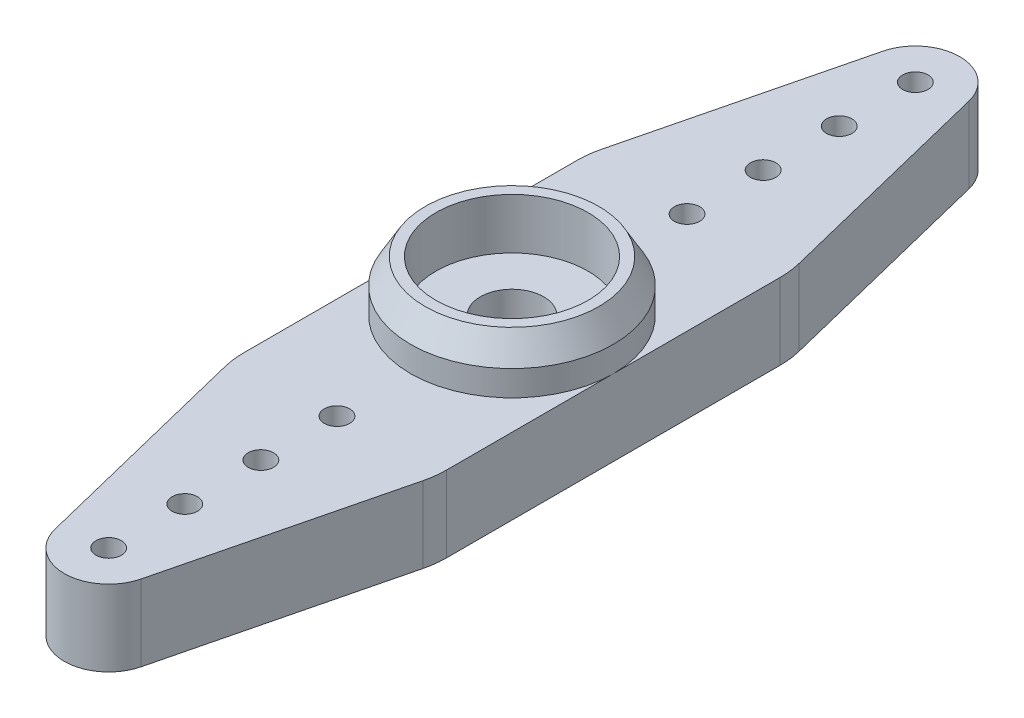
ISO-10303-21;
HEADER;
FILE_DESCRIPTION(('STEP AP214'),'2;1');
FILE_NAME('part.step','',(''),(''),'','','');
FILE_SCHEMA(('AUTOMOTIVE_DESIGN { 1 0 10303 214 1 1 1 1 }'));
ENDSEC;
DATA;
#1=APPLICATION_CONTEXT('core data for automotive mechanical design processes');
#2=APPLICATION_PROTOCOL_DEFINITION('international standard','automotive_design',2000,#1);
#3=PRODUCT_CONTEXT('',#1,'mechanical');
#4=PRODUCT('Part','Part','',(#3));
#5=PRODUCT_RELATED_PRODUCT_CATEGORY('part','',(#4));
#6=PRODUCT_DEFINITION_FORMATION('','',#4);
#7=PRODUCT_DEFINITION_CONTEXT('part definition',#1,'design');
#8=PRODUCT_DEFINITION('design','',#6,#7);
#9=PRODUCT_DEFINITION_SHAPE('','',#8);
#10=(LENGTH_UNIT() NAMED_UNIT(*) SI_UNIT(.MILLI.,.METRE.));
#11=(NAMED_UNIT(*) PLANE_ANGLE_UNIT() SI_UNIT($,.RADIAN.));
#12=(NAMED_UNIT(*) SI_UNIT($,.STERADIAN.) SOLID_ANGLE_UNIT());
#13=UNCERTAINTY_MEASURE_WITH_UNIT(LENGTH_MEASURE(1.E-05),#10,'distance_accuracy_value','');
#14=(GEOMETRIC_REPRESENTATION_CONTEXT(3) GLOBAL_UNCERTAINTY_ASSIGNED_CONTEXT((#13)) GLOBAL_UNIT_ASSIGNED_CONTEXT((#10,
#11,#12)) REPRESENTATION_CONTEXT('',''));
#15=CARTESIAN_POINT('',(0.,0.,0.));
#16=DIRECTION('',(0.,0.,1.));
#17=DIRECTION('',(1.,0.,0.));
#18=AXIS2_PLACEMENT_3D('',#15,#16,#17);
#19=CARTESIAN_POINT('',(0.,3.,0.));
#20=DIRECTION('',(0.,1.,0.));
#21=DIRECTION('',(0.,0.,1.));
#22=AXIS2_PLACEMENT_3D('',#19,#20,#21);
#23=PLANE('',#22);
#24=CARTESIAN_POINT('',(0.,3.,0.));
#25=DIRECTION('',(0.,1.,0.));
#26=DIRECTION('',(0.,0.,1.));
#27=AXIS2_PLACEMENT_3D('',#24,#25,#26);
#28=CIRCLE('',#27,4.);
#29=CARTESIAN_POINT('',(4.,3.,0.));
#30=VERTEX_POINT('',#29);
#31=CARTESIAN_POINT('',(-4.,3.,0.));
#32=VERTEX_POINT('',#31);
#33=EDGE_CURVE('E165',#30,#32,#28,.T.);
#34=ORIENTED_EDGE('',*,*,#33,.F.);
#35=DIRECTION('',(0.,0.,-1.));
#36=VECTOR('',#35,1.);
#37=CARTESIAN_POINT('',(4.,3.,-6.57429368146869));
#38=LINE('',#37,#36);
#39=CARTESIAN_POINT('',(4.,3.,-6.57429368146869));
#40=VERTEX_POINT('',#39);
#41=EDGE_CURVE('E93',#30,#40,#38,.T.);
#42=ORIENTED_EDGE('',*,*,#41,.T.);
#43=CARTESIAN_POINT('',(0.5,3.,-6.57429368146869));
#44=DIRECTION('',(0.,1.,0.));
#45=DIRECTION('',(0.,0.,-1.));
#46=AXIS2_PLACEMENT_3D('',#43,#44,#45);
#47=CIRCLE('',#46,3.5);
#48=CARTESIAN_POINT('',(3.89795205229431,3.,-7.41329418820803));
#49=VERTEX_POINT('',#48);
#50=EDGE_CURVE('E319',#40,#49,#47,.T.);
#51=ORIENTED_EDGE('',*,*,#50,.T.);
#52=DIRECTION('',(-0.239714430496953,0.,-0.970843443512661));
#53=VECTOR('',#52,1.);
#54=CARTESIAN_POINT('',(1.69897602614716,3.,-16.319147094104));
#55=LINE('',#54,#53);
#56=CARTESIAN_POINT('',(1.69897602614716,3.,-16.319147094104));
#57=VERTEX_POINT('',#56);
#58=EDGE_CURVE('E111',#49,#57,#55,.T.);
#59=ORIENTED_EDGE('',*,*,#58,.T.);
#60=CARTESIAN_POINT('',(0.,3.,-15.8996468407343));
#61=DIRECTION('',(0.,1.,0.));
#62=DIRECTION('',(0.,0.,-1.));
#63=AXIS2_PLACEMENT_3D('',#60,#61,#62);
#64=CIRCLE('',#63,1.75);
#65=CARTESIAN_POINT('',(-1.69897602614716,3.,-16.319147094104));
#66=VERTEX_POINT('',#65);
#67=EDGE_CURVE('E104',#57,#66,#64,.T.);
#68=ORIENTED_EDGE('',*,*,#67,.T.);
#69=DIRECTION('',(-0.239714430496953,0.,0.970843443512661));
#70=VECTOR('',#69,1.);
#71=CARTESIAN_POINT('',(-3.89795205229431,3.,-7.41329418820803));
#72=LINE('',#71,#70);
#73=CARTESIAN_POINT('',(-3.89795205229431,3.,-7.41329418820803));
#74=VERTEX_POINT('',#73);
#75=EDGE_CURVE('E108',#66,#74,#72,.T.);
#76=ORIENTED_EDGE('',*,*,#75,.T.);
#77=CARTESIAN_POINT('',(-0.5,3.,-6.57429368146869));
#78=DIRECTION('',(0.,1.,0.));
#79=DIRECTION('',(0.,0.,-1.));
#80=AXIS2_PLACEMENT_3D('',#77,#78,#79);
#81=CIRCLE('',#80,3.5);
#82=CARTESIAN_POINT('',(-4.,3.,-6.57429368146869));
#83=VERTEX_POINT('',#82);
#84=EDGE_CURVE('E58',#74,#83,#81,.T.);
#85=ORIENTED_EDGE('',*,*,#84,.T.);
#86=DIRECTION('',(0.,0.,1.));
#87=VECTOR('',#86,1.);
#88=CARTESIAN_POINT('',(-4.,3.,0.));
#89=LINE('',#88,#87);
#90=EDGE_CURVE('E132',#83,#32,#89,.T.);
#91=ORIENTED_EDGE('',*,*,#90,.T.);
#92=EDGE_LOOP('',(#34,#42,#51,#59,#68,#76,#85,#91));
#93=FACE_BOUND('',#92,.T.);
#94=CARTESIAN_POINT('',(0.,3.,-6.89964684073435));
#95=DIRECTION('',(0.,1.,0.));
#96=DIRECTION('',(0.,0.,1.));
#97=AXIS2_PLACEMENT_3D('',#94,#95,#96);
#98=CIRCLE('',#97,0.500000000000001);
#99=CARTESIAN_POINT('',(0.,3.,-6.39964684073434));
#100=VERTEX_POINT('',#99);
#101=EDGE_CURVE('E293',#100,#100,#98,.T.);
#102=ORIENTED_EDGE('',*,*,#101,.F.);
#103=EDGE_LOOP('',(#102));
#104=FACE_BOUND('',#103,.T.);
#105=CARTESIAN_POINT('',(0.,3.,-12.8996468407343));
#106=DIRECTION('',(0.,1.,0.));
#107=DIRECTION('',(0.,0.,1.));
#108=AXIS2_PLACEMENT_3D('',#105,#106,#107);
#109=CIRCLE('',#108,0.500000000000001);
#110=CARTESIAN_POINT('',(0.,3.,-12.3996468407343));
#111=VERTEX_POINT('',#110);
#112=EDGE_CURVE('E305',#111,#111,#109,.T.);
#113=ORIENTED_EDGE('',*,*,#112,.F.);
#114=EDGE_LOOP('',(#113));
#115=FACE_BOUND('',#114,.T.);
#116=CARTESIAN_POINT('',(0.,3.,-15.8996468407343));
#117=DIRECTION('',(0.,1.,0.));
#118=DIRECTION('',(0.,0.,1.));
#119=AXIS2_PLACEMENT_3D('',#116,#117,#118);
#120=CIRCLE('',#119,0.500000000000001);
#121=CARTESIAN_POINT('',(0.,3.,-15.3996468407343));
#122=VERTEX_POINT('',#121);
#123=EDGE_CURVE('E139',#122,#122,#120,.T.);
#124=ORIENTED_EDGE('',*,*,#123,.F.);
#125=EDGE_LOOP('',(#124));
#126=FACE_BOUND('',#125,.T.);
#127=CARTESIAN_POINT('',(0.,3.,-9.89964684073435));
#128=DIRECTION('',(0.,1.,0.));
#129=DIRECTION('',(0.,0.,1.));
#130=AXIS2_PLACEMENT_3D('',#127,#128,#129);
#131=CIRCLE('',#130,0.500000000000001);
#132=CARTESIAN_POINT('',(0.,3.,-9.39964684073435));
#133=VERTEX_POINT('',#132);
#134=EDGE_CURVE('E299',#133,#133,#131,.T.);
#135=ORIENTED_EDGE('',*,*,#134,.F.);
#136=EDGE_LOOP('',(#135));
#137=FACE_BOUND('',#136,.T.);
#138=ADVANCED_FACE('F34',(#93,#104,#115,#126,#137),#23,.T.);
#139=CARTESIAN_POINT('',(0.,3.,0.));
#140=DIRECTION('',(0.,-1.,0.));
#141=DIRECTION('',(0.,0.,1.));
#142=AXIS2_PLACEMENT_3D('',#139,#140,#141);
#143=CIRCLE('',#142,1.25);
#144=CARTESIAN_POINT('',(0.,3.,1.25));
#145=VERTEX_POINT('',#144);
#146=EDGE_CURVE('E152',#145,#145,#143,.T.);
#147=ORIENTED_EDGE('',*,*,#146,.T.);
#148=EDGE_LOOP('',(#147));
#149=FACE_BOUND('',#148,.T.);
#150=CARTESIAN_POINT('',(0.,3.,0.));
#151=DIRECTION('',(0.,1.,0.));
#152=DIRECTION('',(0.,0.,1.));
#153=AXIS2_PLACEMENT_3D('',#150,#151,#152);
#154=CIRCLE('',#153,3.);
#155=CARTESIAN_POINT('',(0.,3.,3.));
#156=VERTEX_POINT('',#155);
#157=EDGE_CURVE('E177',#156,#156,#154,.T.);
#158=ORIENTED_EDGE('',*,*,#157,.T.);
#159=EDGE_LOOP('',(#158));
#160=FACE_BOUND('',#159,.T.);
#161=ADVANCED_FACE('F184',(#149,#160),#23,.T.);
#162=EDGE_CURVE('E49',#32,#30,#28,.T.);
#163=ORIENTED_EDGE('',*,*,#162,.F.);
#164=CARTESIAN_POINT('',(-4.,3.,6.57429368146869));
#165=VERTEX_POINT('',#164);
#166=EDGE_CURVE('E128',#32,#165,#89,.T.);
#167=ORIENTED_EDGE('',*,*,#166,.T.);
#168=CARTESIAN_POINT('',(-0.5,3.,6.57429368146869));
#169=DIRECTION('',(0.,1.,0.));
#170=DIRECTION('',(0.,0.,1.));
#171=AXIS2_PLACEMENT_3D('',#168,#169,#170);
#172=CIRCLE('',#171,3.5);
#173=CARTESIAN_POINT('',(-3.89795205229431,3.,7.41329418820803));
#174=VERTEX_POINT('',#173);
#175=EDGE_CURVE('E245',#165,#174,#172,.T.);
#176=ORIENTED_EDGE('',*,*,#175,.T.);
#177=DIRECTION('',(0.239714430496953,0.,0.970843443512661));
#178=VECTOR('',#177,1.);
#179=CARTESIAN_POINT('',(-1.69897602614716,3.,16.319147094104));
#180=LINE('',#179,#178);
#181=CARTESIAN_POINT('',(-1.69897602614716,3.,16.319147094104));
#182=VERTEX_POINT('',#181);
#183=EDGE_CURVE('E248',#174,#182,#180,.T.);
#184=ORIENTED_EDGE('',*,*,#183,.T.);
#185=CARTESIAN_POINT('',(0.,3.,15.8996468407343));
#186=DIRECTION('',(0.,1.,0.));
#187=DIRECTION('',(0.,0.,1.));
#188=AXIS2_PLACEMENT_3D('',#185,#186,#187);
#189=CIRCLE('',#188,1.75);
#190=CARTESIAN_POINT('',(1.69897602614716,3.,16.319147094104));
#191=VERTEX_POINT('',#190);
#192=EDGE_CURVE('E252',#182,#191,#189,.T.);
#193=ORIENTED_EDGE('',*,*,#192,.T.);
#194=DIRECTION('',(0.239714430496953,0.,-0.970843443512661));
#195=VECTOR('',#194,1.);
#196=CARTESIAN_POINT('',(3.89795205229431,3.,7.41329418820803));
#197=LINE('',#196,#195);
#198=CARTESIAN_POINT('',(3.89795205229431,3.,7.41329418820803));
#199=VERTEX_POINT('',#198);
#200=EDGE_CURVE('E255',#191,#199,#197,.T.);
#201=ORIENTED_EDGE('',*,*,#200,.T.);
#202=CARTESIAN_POINT('',(0.5,3.,6.57429368146869));
#203=DIRECTION('',(0.,1.,0.));
#204=DIRECTION('',(0.,0.,1.));
#205=AXIS2_PLACEMENT_3D('',#202,#203,#204);
#206=CIRCLE('',#205,3.5);
#207=CARTESIAN_POINT('',(4.,3.,6.57429368146869));
#208=VERTEX_POINT('',#207);
#209=EDGE_CURVE('E258',#199,#208,#206,.T.);
#210=ORIENTED_EDGE('',*,*,#209,.T.);
#211=EDGE_CURVE('E317',#208,#30,#38,.T.);
#212=ORIENTED_EDGE('',*,*,#211,.T.);
#213=EDGE_LOOP('',(#163,#167,#176,#184,#193,#201,#210,#212));
#214=FACE_BOUND('',#213,.T.);
#215=CARTESIAN_POINT('',(0.,3.,9.89964684073435));
#216=DIRECTION('',(0.,1.,0.));
#217=DIRECTION('',(0.,0.,-1.));
#218=AXIS2_PLACEMENT_3D('',#215,#216,#217);
#219=CIRCLE('',#218,0.500000000000001);
#220=CARTESIAN_POINT('',(0.,3.,9.39964684073435));
#221=VERTEX_POINT('',#220);
#222=EDGE_CURVE('E219',#221,#221,#219,.T.);
#223=ORIENTED_EDGE('',*,*,#222,.F.);
#224=EDGE_LOOP('',(#223));
#225=FACE_BOUND('',#224,.T.);
#226=CARTESIAN_POINT('',(0.,3.,15.8996468407343));
#227=DIRECTION('',(0.,1.,0.));
#228=DIRECTION('',(0.,0.,-1.));
#229=AXIS2_PLACEMENT_3D('',#226,#227,#228);
#230=CIRCLE('',#229,0.500000000000001);
#231=CARTESIAN_POINT('',(0.,3.,15.3996468407343));
#232=VERTEX_POINT('',#231);
#233=EDGE_CURVE('E223',#232,#232,#230,.T.);
#234=ORIENTED_EDGE('',*,*,#233,.F.);
#235=EDGE_LOOP('',(#234));
#236=FACE_BOUND('',#235,.T.);
#237=CARTESIAN_POINT('',(0.,3.,12.8996468407343));
#238=DIRECTION('',(0.,1.,0.));
#239=DIRECTION('',(0.,0.,-1.));
#240=AXIS2_PLACEMENT_3D('',#237,#238,#239);
#241=CIRCLE('',#240,0.500000000000001);
#242=CARTESIAN_POINT('',(0.,3.,12.3996468407343));
#243=VERTEX_POINT('',#242);
#244=EDGE_CURVE('E227',#243,#243,#241,.T.);
#245=ORIENTED_EDGE('',*,*,#244,.F.);
#246=EDGE_LOOP('',(#245));
#247=FACE_BOUND('',#246,.T.);
#248=CARTESIAN_POINT('',(0.,3.,6.89964684073435));
#249=DIRECTION('',(0.,1.,0.));
#250=DIRECTION('',(0.,0.,-1.));
#251=AXIS2_PLACEMENT_3D('',#248,#249,#250);
#252=CIRCLE('',#251,0.500000000000001);
#253=CARTESIAN_POINT('',(0.,3.,6.39964684073434));
#254=VERTEX_POINT('',#253);
#255=EDGE_CURVE('E174',#254,#254,#252,.T.);
#256=ORIENTED_EDGE('',*,*,#255,.F.);
#257=EDGE_LOOP('',(#256));
#258=FACE_BOUND('',#257,.T.);
#259=ADVANCED_FACE('F201',(#214,#225,#236,#247,#258),#23,.T.);
#260=CARTESIAN_POINT('',(0.,0.,0.));
#261=DIRECTION('',(0.,1.,0.));
#262=DIRECTION('',(0.,0.,1.));
#263=AXIS2_PLACEMENT_3D('',#260,#261,#262);
#264=PLANE('',#263);
#265=CARTESIAN_POINT('',(0.,0.,0.));
#266=DIRECTION('',(0.,-1.,0.));
#267=DIRECTION('',(0.,0.,1.));
#268=AXIS2_PLACEMENT_3D('',#265,#266,#267);
#269=CIRCLE('',#268,1.25);
#270=CARTESIAN_POINT('',(0.,0.,1.25));
#271=VERTEX_POINT('',#270);
#272=EDGE_CURVE('E135',#271,#271,#269,.T.);
#273=ORIENTED_EDGE('',*,*,#272,.F.);
#274=EDGE_LOOP('',(#273));
#275=FACE_BOUND('',#274,.T.);
#276=CARTESIAN_POINT('',(-0.5,0.,6.57429368146869));
#277=DIRECTION('',(0.,1.,0.));
#278=DIRECTION('',(0.,0.,1.));
#279=AXIS2_PLACEMENT_3D('',#276,#277,#278);
#280=CIRCLE('',#279,3.5);
#281=CARTESIAN_POINT('',(-4.,0.,6.57429368146869));
#282=VERTEX_POINT('',#281);
#283=CARTESIAN_POINT('',(-3.89795205229431,0.,7.41329418820803));
#284=VERTEX_POINT('',#283);
#285=EDGE_CURVE('E242',#282,#284,#280,.T.);
#286=ORIENTED_EDGE('',*,*,#285,.F.);
#287=DIRECTION('',(0.,0.,1.));
#288=VECTOR('',#287,1.);
#289=CARTESIAN_POINT('',(-4.,0.,0.));
#290=LINE('',#289,#288);
#291=CARTESIAN_POINT('',(-4.,0.,-6.57429368146869));
#292=VERTEX_POINT('',#291);
#293=EDGE_CURVE('E149',#292,#282,#290,.T.);
#294=ORIENTED_EDGE('',*,*,#293,.F.);
#295=CARTESIAN_POINT('',(-0.5,0.,-6.57429368146869));
#296=DIRECTION('',(0.,1.,0.));
#297=DIRECTION('',(0.,0.,-1.));
#298=AXIS2_PLACEMENT_3D('',#295,#296,#297);
#299=CIRCLE('',#298,3.5);
#300=CARTESIAN_POINT('',(-3.89795205229431,0.,-7.41329418820803));
#301=VERTEX_POINT('',#300);
#302=EDGE_CURVE('E85',#301,#292,#299,.T.);
#303=ORIENTED_EDGE('',*,*,#302,.F.);
#304=DIRECTION('',(-0.239714430496953,0.,0.970843443512661));
#305=VECTOR('',#304,1.);
#306=CARTESIAN_POINT('',(-3.89795205229431,0.,-7.41329418820803));
#307=LINE('',#306,#305);
#308=CARTESIAN_POINT('',(-1.69897602614716,0.,-16.319147094104));
#309=VERTEX_POINT('',#308);
#310=EDGE_CURVE('E146',#309,#301,#307,.T.);
#311=ORIENTED_EDGE('',*,*,#310,.F.);
#312=CARTESIAN_POINT('',(0.,0.,-15.8996468407343));
#313=DIRECTION('',(0.,1.,0.));
#314=DIRECTION('',(0.,0.,-1.));
#315=AXIS2_PLACEMENT_3D('',#312,#313,#314);
#316=CIRCLE('',#315,1.75);
#317=CARTESIAN_POINT('',(1.69897602614716,0.,-16.319147094104));
#318=VERTEX_POINT('',#317);
#319=EDGE_CURVE('E120',#318,#309,#316,.T.);
#320=ORIENTED_EDGE('',*,*,#319,.F.);
#321=DIRECTION('',(-0.239714430496953,0.,-0.970843443512661));
#322=VECTOR('',#321,1.);
#323=CARTESIAN_POINT('',(1.69897602614716,0.,-16.319147094104));
#324=LINE('',#323,#322);
#325=CARTESIAN_POINT('',(3.89795205229431,0.,-7.41329418820803));
#326=VERTEX_POINT('',#325);
#327=EDGE_CURVE('E143',#326,#318,#324,.T.);
#328=ORIENTED_EDGE('',*,*,#327,.F.);
#329=CARTESIAN_POINT('',(0.5,0.,-6.57429368146869));
#330=DIRECTION('',(0.,1.,0.));
#331=DIRECTION('',(0.,0.,-1.));
#332=AXIS2_PLACEMENT_3D('',#329,#330,#331);
#333=CIRCLE('',#332,3.5);
#334=CARTESIAN_POINT('',(4.,0.,-6.57429368146869));
#335=VERTEX_POINT('',#334);
#336=EDGE_CURVE('E141',#335,#326,#333,.T.);
#337=ORIENTED_EDGE('',*,*,#336,.F.);
#338=DIRECTION('',(0.,0.,-1.));
#339=VECTOR('',#338,1.);
#340=CARTESIAN_POINT('',(4.,0.,-6.57429368146869));
#341=LINE('',#340,#339);
#342=CARTESIAN_POINT('',(4.,0.,6.57429368146869));
#343=VERTEX_POINT('',#342);
#344=EDGE_CURVE('E138',#343,#335,#341,.T.);
#345=ORIENTED_EDGE('',*,*,#344,.F.);
#346=CARTESIAN_POINT('',(0.5,0.,6.57429368146869));
#347=DIRECTION('',(0.,1.,0.));
#348=DIRECTION('',(0.,0.,1.));
#349=AXIS2_PLACEMENT_3D('',#346,#347,#348);
#350=CIRCLE('',#349,3.5);
#351=CARTESIAN_POINT('',(3.89795205229431,0.,7.41329418820803));
#352=VERTEX_POINT('',#351);
#353=EDGE_CURVE('E249',#352,#343,#350,.T.);
#354=ORIENTED_EDGE('',*,*,#353,.F.);
#355=DIRECTION('',(0.239714430496953,0.,-0.970843443512661));
#356=VECTOR('',#355,1.);
#357=CARTESIAN_POINT('',(3.89795205229431,0.,7.41329418820803));
#358=LINE('',#357,#356);
#359=CARTESIAN_POINT('',(1.69897602614716,0.,16.319147094104));
#360=VERTEX_POINT('',#359);
#361=EDGE_CURVE('E270',#360,#352,#358,.T.);
#362=ORIENTED_EDGE('',*,*,#361,.F.);
#363=CARTESIAN_POINT('',(0.,0.,15.8996468407343));
#364=DIRECTION('',(0.,1.,0.));
#365=DIRECTION('',(0.,0.,1.));
#366=AXIS2_PLACEMENT_3D('',#363,#364,#365);
#367=CIRCLE('',#366,1.75);
#368=CARTESIAN_POINT('',(-1.69897602614716,0.,16.319147094104));
#369=VERTEX_POINT('',#368);
#370=EDGE_CURVE('E267',#369,#360,#367,.T.);
#371=ORIENTED_EDGE('',*,*,#370,.F.);
#372=DIRECTION('',(0.239714430496953,0.,0.970843443512661));
#373=VECTOR('',#372,1.);
#374=CARTESIAN_POINT('',(-1.69897602614716,0.,16.319147094104));
#375=LINE('',#374,#373);
#376=EDGE_CURVE('E264',#284,#369,#375,.T.);
#377=ORIENTED_EDGE('',*,*,#376,.F.);
#378=EDGE_LOOP('',(#286,#294,#303,#311,#320,#328,#337,#345,#354,#362,#371,#377));
#379=FACE_BOUND('',#378,.T.);
#380=CARTESIAN_POINT('',(0.,0.,-15.8996468407343));
#381=DIRECTION('',(0.,1.,0.));
#382=DIRECTION('',(0.,0.,1.));
#383=AXIS2_PLACEMENT_3D('',#380,#381,#382);
#384=CIRCLE('',#383,0.500000000000001);
#385=CARTESIAN_POINT('',(0.,0.,-15.3996468407343));
#386=VERTEX_POINT('',#385);
#387=EDGE_CURVE('E308',#386,#386,#384,.T.);
#388=ORIENTED_EDGE('',*,*,#387,.T.);
#389=EDGE_LOOP('',(#388));
#390=FACE_BOUND('',#389,.T.);
#391=CARTESIAN_POINT('',(0.,0.,-12.8996468407343));
#392=DIRECTION('',(0.,1.,0.));
#393=DIRECTION('',(0.,0.,1.));
#394=AXIS2_PLACEMENT_3D('',#391,#392,#393);
#395=CIRCLE('',#394,0.500000000000001);
#396=CARTESIAN_POINT('',(0.,0.,-12.3996468407343));
#397=VERTEX_POINT('',#396);
#398=EDGE_CURVE('E302',#397,#397,#395,.T.);
#399=ORIENTED_EDGE('',*,*,#398,.T.);
#400=EDGE_LOOP('',(#399));
#401=FACE_BOUND('',#400,.T.);
#402=CARTESIAN_POINT('',(0.,0.,-9.89964684073435));
#403=DIRECTION('',(0.,1.,0.));
#404=DIRECTION('',(0.,0.,1.));
#405=AXIS2_PLACEMENT_3D('',#402,#403,#404);
#406=CIRCLE('',#405,0.500000000000001);
#407=CARTESIAN_POINT('',(0.,0.,-9.39964684073435));
#408=VERTEX_POINT('',#407);
#409=EDGE_CURVE('E296',#408,#408,#406,.T.);
#410=ORIENTED_EDGE('',*,*,#409,.T.);
#411=EDGE_LOOP('',(#410));
#412=FACE_BOUND('',#411,.T.);
#413=CARTESIAN_POINT('',(0.,0.,-6.89964684073435));
#414=DIRECTION('',(0.,1.,0.));
#415=DIRECTION('',(0.,0.,1.));
#416=AXIS2_PLACEMENT_3D('',#413,#414,#415);
#417=CIRCLE('',#416,0.500000000000001);
#418=CARTESIAN_POINT('',(0.,0.,-6.39964684073434));
#419=VERTEX_POINT('',#418);
#420=EDGE_CURVE('E292',#419,#419,#417,.T.);
#421=ORIENTED_EDGE('',*,*,#420,.T.);
#422=EDGE_LOOP('',(#421));
#423=FACE_BOUND('',#422,.T.);
#424=CARTESIAN_POINT('',(0.,0.,15.8996468407343));
#425=DIRECTION('',(0.,1.,0.));
#426=DIRECTION('',(0.,0.,-1.));
#427=AXIS2_PLACEMENT_3D('',#424,#425,#426);
#428=CIRCLE('',#427,0.500000000000001);
#429=CARTESIAN_POINT('',(0.,0.,15.3996468407343));
#430=VERTEX_POINT('',#429);
#431=EDGE_CURVE('E238',#430,#430,#428,.T.);
#432=ORIENTED_EDGE('',*,*,#431,.T.);
#433=EDGE_LOOP('',(#432));
#434=FACE_BOUND('',#433,.T.);
#435=CARTESIAN_POINT('',(0.,0.,12.8996468407343));
#436=DIRECTION('',(0.,1.,0.));
#437=DIRECTION('',(0.,0.,-1.));
#438=AXIS2_PLACEMENT_3D('',#435,#436,#437);
#439=CIRCLE('',#438,0.500000000000001);
#440=CARTESIAN_POINT('',(0.,0.,12.3996468407343));
#441=VERTEX_POINT('',#440);
#442=EDGE_CURVE('E235',#441,#441,#439,.T.);
#443=ORIENTED_EDGE('',*,*,#442,.T.);
#444=EDGE_LOOP('',(#443));
#445=FACE_BOUND('',#444,.T.);
#446=CARTESIAN_POINT('',(0.,0.,9.89964684073435));
#447=DIRECTION('',(0.,1.,0.));
#448=DIRECTION('',(0.,0.,-1.));
#449=AXIS2_PLACEMENT_3D('',#446,#447,#448);
#450=CIRCLE('',#449,0.500000000000001);
#451=CARTESIAN_POINT('',(0.,0.,9.39964684073435));
#452=VERTEX_POINT('',#451);
#453=EDGE_CURVE('E231',#452,#452,#450,.T.);
#454=ORIENTED_EDGE('',*,*,#453,.T.);
#455=EDGE_LOOP('',(#454));
#456=FACE_BOUND('',#455,.T.);
#457=CARTESIAN_POINT('',(0.,0.,6.89964684073435));
#458=DIRECTION('',(0.,1.,0.));
#459=DIRECTION('',(0.,0.,-1.));
#460=AXIS2_PLACEMENT_3D('',#457,#458,#459);
#461=CIRCLE('',#460,0.500000000000001);
#462=CARTESIAN_POINT('',(0.,0.,6.39964684073434));
#463=VERTEX_POINT('',#462);
#464=EDGE_CURVE('E171',#463,#463,#461,.T.);
#465=ORIENTED_EDGE('',*,*,#464,.T.);
#466=EDGE_LOOP('',(#465));
#467=FACE_BOUND('',#466,.T.);
#468=ADVANCED_FACE('F209',(#275,#379,#390,#401,#412,#423,#434,#445,#456,#467),#264,.F.);
#469=CARTESIAN_POINT('',(0.,3.,0.));
#470=DIRECTION('',(0.,-1.,0.));
#471=DIRECTION('',(0.,0.,-1.));
#472=AXIS2_PLACEMENT_3D('',#469,#470,#471);
#473=CYLINDRICAL_SURFACE('',#472,1.25);
#474=ORIENTED_EDGE('',*,*,#272,.T.);
#475=EDGE_LOOP('',(#474));
#476=FACE_BOUND('',#475,.T.);
#477=ORIENTED_EDGE('',*,*,#146,.F.);
#478=EDGE_LOOP('',(#477));
#479=FACE_BOUND('',#478,.T.);
#480=ADVANCED_FACE('F213',(#476,#479),#473,.F.);
#481=CARTESIAN_POINT('',(4.,3.,-6.57429368146869));
#482=DIRECTION('',(-1.,0.,0.));
#483=DIRECTION('',(0.,0.,1.));
#484=AXIS2_PLACEMENT_3D('',#481,#482,#483);
#485=PLANE('',#484);
#486=ORIENTED_EDGE('',*,*,#344,.T.);
#487=DIRECTION('',(0.,-1.,0.));
#488=VECTOR('',#487,1.);
#489=CARTESIAN_POINT('',(4.,3.,-6.57429368146869));
#490=LINE('',#489,#488);
#491=EDGE_CURVE('E159',#40,#335,#490,.T.);
#492=ORIENTED_EDGE('',*,*,#491,.F.);
#493=ORIENTED_EDGE('',*,*,#41,.F.);
#494=ORIENTED_EDGE('',*,*,#211,.F.);
#495=DIRECTION('',(0.,-1.,0.));
#496=VECTOR('',#495,1.);
#497=CARTESIAN_POINT('',(4.,3.,6.57429368146869));
#498=LINE('',#497,#496);
#499=EDGE_CURVE('E261',#208,#343,#498,.T.);
#500=ORIENTED_EDGE('',*,*,#499,.T.);
#501=EDGE_LOOP('',(#486,#492,#493,#494,#500));
#502=FACE_BOUND('',#501,.T.);
#503=ADVANCED_FACE('F369',(#502),#485,.F.);
#504=CARTESIAN_POINT('',(0.5,3.,-6.57429368146869));
#505=DIRECTION('',(0.,-1.,0.));
#506=DIRECTION('',(0.,0.,-1.));
#507=AXIS2_PLACEMENT_3D('',#504,#505,#506);
#508=CYLINDRICAL_SURFACE('',#507,3.5);
#509=ORIENTED_EDGE('',*,*,#336,.T.);
#510=DIRECTION('',(0.,-1.,0.));
#511=VECTOR('',#510,1.);
#512=CARTESIAN_POINT('',(3.89795205229431,3.,-7.41329418820803));
#513=LINE('',#512,#511);
#514=EDGE_CURVE('E156',#49,#326,#513,.T.);
#515=ORIENTED_EDGE('',*,*,#514,.F.);
#516=ORIENTED_EDGE('',*,*,#50,.F.);
#517=ORIENTED_EDGE('',*,*,#491,.T.);
#518=EDGE_LOOP('',(#509,#515,#516,#517));
#519=FACE_BOUND('',#518,.T.);
#520=ADVANCED_FACE('F323',(#519),#508,.T.);
#521=CARTESIAN_POINT('',(1.69897602614716,3.,-16.319147094104));
#522=DIRECTION('',(-0.970843443512661,0.,0.239714430496953));
#523=DIRECTION('',(0.239714430496953,0.,0.970843443512661));
#524=AXIS2_PLACEMENT_3D('',#521,#522,#523);
#525=PLANE('',#524);
#526=ORIENTED_EDGE('',*,*,#327,.T.);
#527=DIRECTION('',(0.,-1.,0.));
#528=VECTOR('',#527,1.);
#529=CARTESIAN_POINT('',(1.69897602614716,3.,-16.319147094104));
#530=LINE('',#529,#528);
#531=EDGE_CURVE('E123',#57,#318,#530,.T.);
#532=ORIENTED_EDGE('',*,*,#531,.F.);
#533=ORIENTED_EDGE('',*,*,#58,.F.);
#534=ORIENTED_EDGE('',*,*,#514,.T.);
#535=EDGE_LOOP('',(#526,#532,#533,#534));
#536=FACE_BOUND('',#535,.T.);
#537=ADVANCED_FACE('F327',(#536),#525,.F.);
#538=CARTESIAN_POINT('',(0.,3.,-15.8996468407343));
#539=DIRECTION('',(0.,-1.,0.));
#540=DIRECTION('',(0.,0.,-1.));
#541=AXIS2_PLACEMENT_3D('',#538,#539,#540);
#542=CYLINDRICAL_SURFACE('',#541,1.75);
#543=ORIENTED_EDGE('',*,*,#319,.T.);
#544=DIRECTION('',(0.,-1.,0.));
#545=VECTOR('',#544,1.);
#546=CARTESIAN_POINT('',(-1.69897602614716,3.,-16.319147094104));
#547=LINE('',#546,#545);
#548=EDGE_CURVE('E117',#66,#309,#547,.T.);
#549=ORIENTED_EDGE('',*,*,#548,.F.);
#550=ORIENTED_EDGE('',*,*,#67,.F.);
#551=ORIENTED_EDGE('',*,*,#531,.T.);
#552=EDGE_LOOP('',(#543,#549,#550,#551));
#553=FACE_BOUND('',#552,.T.);
#554=ADVANCED_FACE('F118',(#553),#542,.T.);
#555=CARTESIAN_POINT('',(-3.89795205229431,3.,-7.41329418820803));
#556=DIRECTION('',(0.970843443512661,0.,0.239714430496953));
#557=DIRECTION('',(0.239714430496953,0.,-0.970843443512661));
#558=AXIS2_PLACEMENT_3D('',#555,#556,#557);
#559=PLANE('',#558);
#560=ORIENTED_EDGE('',*,*,#310,.T.);
#561=DIRECTION('',(0.,-1.,0.));
#562=VECTOR('',#561,1.);
#563=CARTESIAN_POINT('',(-3.89795205229431,3.,-7.41329418820803));
#564=LINE('',#563,#562);
#565=EDGE_CURVE('E124',#74,#301,#564,.T.);
#566=ORIENTED_EDGE('',*,*,#565,.F.);
#567=ORIENTED_EDGE('',*,*,#75,.F.);
#568=ORIENTED_EDGE('',*,*,#548,.T.);
#569=EDGE_LOOP('',(#560,#566,#567,#568));
#570=FACE_BOUND('',#569,.T.);
#571=ADVANCED_FACE('F126',(#570),#559,.F.);
#572=CARTESIAN_POINT('',(-0.5,3.,-6.57429368146869));
#573=DIRECTION('',(0.,-1.,0.));
#574=DIRECTION('',(0.,0.,-1.));
#575=AXIS2_PLACEMENT_3D('',#572,#573,#574);
#576=CYLINDRICAL_SURFACE('',#575,3.5);
#577=ORIENTED_EDGE('',*,*,#302,.T.);
#578=DIRECTION('',(0.,-1.,0.));
#579=VECTOR('',#578,1.);
#580=CARTESIAN_POINT('',(-4.,3.,-6.57429368146869));
#581=LINE('',#580,#579);
#582=EDGE_CURVE('E134',#83,#292,#581,.T.);
#583=ORIENTED_EDGE('',*,*,#582,.F.);
#584=ORIENTED_EDGE('',*,*,#84,.F.);
#585=ORIENTED_EDGE('',*,*,#565,.T.);
#586=EDGE_LOOP('',(#577,#583,#584,#585));
#587=FACE_BOUND('',#586,.T.);
#588=ADVANCED_FACE('F332',(#587),#576,.T.);
#589=CARTESIAN_POINT('',(-4.,3.,0.));
#590=DIRECTION('',(1.,0.,0.));
#591=DIRECTION('',(0.,0.,-1.));
#592=AXIS2_PLACEMENT_3D('',#589,#590,#591);
#593=PLANE('',#592);
#594=ORIENTED_EDGE('',*,*,#293,.T.);
#595=DIRECTION('',(0.,-1.,0.));
#596=VECTOR('',#595,1.);
#597=CARTESIAN_POINT('',(-4.,3.,6.57429368146869));
#598=LINE('',#597,#596);
#599=EDGE_CURVE('E289',#165,#282,#598,.T.);
#600=ORIENTED_EDGE('',*,*,#599,.F.);
#601=ORIENTED_EDGE('',*,*,#166,.F.);
#602=ORIENTED_EDGE('',*,*,#90,.F.);
#603=ORIENTED_EDGE('',*,*,#582,.T.);
#604=EDGE_LOOP('',(#594,#600,#601,#602,#603));
#605=FACE_BOUND('',#604,.T.);
#606=ADVANCED_FACE('F335',(#605),#593,.F.);
#607=CARTESIAN_POINT('',(0.,3.,-15.8996468407343));
#608=DIRECTION('',(0.,-1.,0.));
#609=DIRECTION('',(0.,0.,-1.));
#610=AXIS2_PLACEMENT_3D('',#607,#608,#609);
#611=CYLINDRICAL_SURFACE('',#610,0.500000000000001);
#612=ORIENTED_EDGE('',*,*,#123,.T.);
#613=EDGE_LOOP('',(#612));
#614=FACE_BOUND('',#613,.T.);
#615=ORIENTED_EDGE('',*,*,#387,.F.);
#616=EDGE_LOOP('',(#615));
#617=FACE_BOUND('',#616,.T.);
#618=ADVANCED_FACE('F405',(#614,#617),#611,.F.);
#619=CARTESIAN_POINT('',(0.,3.,-12.8996468407343));
#620=DIRECTION('',(0.,-1.,0.));
#621=DIRECTION('',(0.,0.,-1.));
#622=AXIS2_PLACEMENT_3D('',#619,#620,#621);
#623=CYLINDRICAL_SURFACE('',#622,0.500000000000001);
#624=ORIENTED_EDGE('',*,*,#112,.T.);
#625=EDGE_LOOP('',(#624));
#626=FACE_BOUND('',#625,.T.);
#627=ORIENTED_EDGE('',*,*,#398,.F.);
#628=EDGE_LOOP('',(#627));
#629=FACE_BOUND('',#628,.T.);
#630=ADVANCED_FACE('F402',(#626,#629),#623,.F.);
#631=CARTESIAN_POINT('',(0.,3.,-9.89964684073435));
#632=DIRECTION('',(0.,-1.,0.));
#633=DIRECTION('',(0.,0.,-1.));
#634=AXIS2_PLACEMENT_3D('',#631,#632,#633);
#635=CYLINDRICAL_SURFACE('',#634,0.500000000000001);
#636=ORIENTED_EDGE('',*,*,#134,.T.);
#637=EDGE_LOOP('',(#636));
#638=FACE_BOUND('',#637,.T.);
#639=ORIENTED_EDGE('',*,*,#409,.F.);
#640=EDGE_LOOP('',(#639));
#641=FACE_BOUND('',#640,.T.);
#642=ADVANCED_FACE('F398',(#638,#641),#635,.F.);
#643=CARTESIAN_POINT('',(0.,3.,-6.89964684073435));
#644=DIRECTION('',(0.,-1.,0.));
#645=DIRECTION('',(0.,0.,-1.));
#646=AXIS2_PLACEMENT_3D('',#643,#644,#645);
#647=CYLINDRICAL_SURFACE('',#646,0.500000000000001);
#648=ORIENTED_EDGE('',*,*,#101,.T.);
#649=EDGE_LOOP('',(#648));
#650=FACE_BOUND('',#649,.T.);
#651=ORIENTED_EDGE('',*,*,#420,.F.);
#652=EDGE_LOOP('',(#651));
#653=FACE_BOUND('',#652,.T.);
#654=ADVANCED_FACE('F394',(#650,#653),#647,.F.);
#655=CARTESIAN_POINT('',(-0.5,3.,6.57429368146869));
#656=DIRECTION('',(0.,-1.,0.));
#657=DIRECTION('',(0.,0.,-1.));
#658=AXIS2_PLACEMENT_3D('',#655,#656,#657);
#659=CYLINDRICAL_SURFACE('',#658,3.5);
#660=ORIENTED_EDGE('',*,*,#285,.T.);
#661=DIRECTION('',(0.,-1.,0.));
#662=VECTOR('',#661,1.);
#663=CARTESIAN_POINT('',(-3.89795205229431,3.,7.41329418820803));
#664=LINE('',#663,#662);
#665=EDGE_CURVE('E286',#174,#284,#664,.T.);
#666=ORIENTED_EDGE('',*,*,#665,.F.);
#667=ORIENTED_EDGE('',*,*,#175,.F.);
#668=ORIENTED_EDGE('',*,*,#599,.T.);
#669=EDGE_LOOP('',(#660,#666,#667,#668));
#670=FACE_BOUND('',#669,.T.);
#671=ADVANCED_FACE('F390',(#670),#659,.T.);
#672=CARTESIAN_POINT('',(-1.69897602614716,3.,16.319147094104));
#673=DIRECTION('',(0.970843443512661,0.,-0.239714430496953));
#674=DIRECTION('',(-0.239714430496953,0.,-0.970843443512661));
#675=AXIS2_PLACEMENT_3D('',#672,#673,#674);
#676=PLANE('',#675);
#677=ORIENTED_EDGE('',*,*,#376,.T.);
#678=DIRECTION('',(0.,-1.,0.));
#679=VECTOR('',#678,1.);
#680=CARTESIAN_POINT('',(-1.69897602614716,3.,16.319147094104));
#681=LINE('',#680,#679);
#682=EDGE_CURVE('E283',#182,#369,#681,.T.);
#683=ORIENTED_EDGE('',*,*,#682,.F.);
#684=ORIENTED_EDGE('',*,*,#183,.F.);
#685=ORIENTED_EDGE('',*,*,#665,.T.);
#686=EDGE_LOOP('',(#677,#683,#684,#685));
#687=FACE_BOUND('',#686,.T.);
#688=ADVANCED_FACE('F383',(#687),#676,.F.);
#689=CARTESIAN_POINT('',(0.,3.,15.8996468407343));
#690=DIRECTION('',(0.,-1.,0.));
#691=DIRECTION('',(0.,0.,-1.));
#692=AXIS2_PLACEMENT_3D('',#689,#690,#691);
#693=CYLINDRICAL_SURFACE('',#692,1.75);
#694=ORIENTED_EDGE('',*,*,#370,.T.);
#695=DIRECTION('',(0.,-1.,0.));
#696=VECTOR('',#695,1.);
#697=CARTESIAN_POINT('',(1.69897602614716,3.,16.319147094104));
#698=LINE('',#697,#696);
#699=EDGE_CURVE('E280',#191,#360,#698,.T.);
#700=ORIENTED_EDGE('',*,*,#699,.F.);
#701=ORIENTED_EDGE('',*,*,#192,.F.);
#702=ORIENTED_EDGE('',*,*,#682,.T.);
#703=EDGE_LOOP('',(#694,#700,#701,#702));
#704=FACE_BOUND('',#703,.T.);
#705=ADVANCED_FACE('F375',(#704),#693,.T.);
#706=CARTESIAN_POINT('',(3.89795205229431,3.,7.41329418820803));
#707=DIRECTION('',(-0.970843443512661,0.,-0.239714430496953));
#708=DIRECTION('',(-0.239714430496953,0.,0.970843443512661));
#709=AXIS2_PLACEMENT_3D('',#706,#707,#708);
#710=PLANE('',#709);
#711=ORIENTED_EDGE('',*,*,#361,.T.);
#712=DIRECTION('',(0.,-1.,0.));
#713=VECTOR('',#712,1.);
#714=CARTESIAN_POINT('',(3.89795205229431,3.,7.41329418820803));
#715=LINE('',#714,#713);
#716=EDGE_CURVE('E277',#199,#352,#715,.T.);
#717=ORIENTED_EDGE('',*,*,#716,.F.);
#718=ORIENTED_EDGE('',*,*,#200,.F.);
#719=ORIENTED_EDGE('',*,*,#699,.T.);
#720=EDGE_LOOP('',(#711,#717,#718,#719));
#721=FACE_BOUND('',#720,.T.);
#722=ADVANCED_FACE('F373',(#721),#710,.F.);
#723=CARTESIAN_POINT('',(0.5,3.,6.57429368146869));
#724=DIRECTION('',(0.,-1.,0.));
#725=DIRECTION('',(0.,0.,-1.));
#726=AXIS2_PLACEMENT_3D('',#723,#724,#725);
#727=CYLINDRICAL_SURFACE('',#726,3.5);
#728=ORIENTED_EDGE('',*,*,#353,.T.);
#729=ORIENTED_EDGE('',*,*,#499,.F.);
#730=ORIENTED_EDGE('',*,*,#209,.F.);
#731=ORIENTED_EDGE('',*,*,#716,.T.);
#732=EDGE_LOOP('',(#728,#729,#730,#731));
#733=FACE_BOUND('',#732,.T.);
#734=ADVANCED_FACE('F367',(#733),#727,.T.);
#735=CARTESIAN_POINT('',(0.,3.,15.8996468407343));
#736=DIRECTION('',(0.,-1.,0.));
#737=DIRECTION('',(0.,0.,-1.));
#738=AXIS2_PLACEMENT_3D('',#735,#736,#737);
#739=CYLINDRICAL_SURFACE('',#738,0.500000000000001);
#740=ORIENTED_EDGE('',*,*,#233,.T.);
#741=EDGE_LOOP('',(#740));
#742=FACE_BOUND('',#741,.T.);
#743=ORIENTED_EDGE('',*,*,#431,.F.);
#744=EDGE_LOOP('',(#743));
#745=FACE_BOUND('',#744,.T.);
#746=ADVANCED_FACE('F381',(#742,#745),#739,.F.);
#747=CARTESIAN_POINT('',(0.,3.,12.8996468407343));
#748=DIRECTION('',(0.,-1.,0.));
#749=DIRECTION('',(0.,0.,-1.));
#750=AXIS2_PLACEMENT_3D('',#747,#748,#749);
#751=CYLINDRICAL_SURFACE('',#750,0.500000000000001);
#752=ORIENTED_EDGE('',*,*,#244,.T.);
#753=EDGE_LOOP('',(#752));
#754=FACE_BOUND('',#753,.T.);
#755=ORIENTED_EDGE('',*,*,#442,.F.);
#756=EDGE_LOOP('',(#755));
#757=FACE_BOUND('',#756,.T.);
#758=ADVANCED_FACE('F439',(#754,#757),#751,.F.);
#759=CARTESIAN_POINT('',(0.,3.,9.89964684073435));
#760=DIRECTION('',(0.,-1.,0.));
#761=DIRECTION('',(0.,0.,-1.));
#762=AXIS2_PLACEMENT_3D('',#759,#760,#761);
#763=CYLINDRICAL_SURFACE('',#762,0.500000000000001);
#764=ORIENTED_EDGE('',*,*,#222,.T.);
#765=EDGE_LOOP('',(#764));
#766=FACE_BOUND('',#765,.T.);
#767=ORIENTED_EDGE('',*,*,#453,.F.);
#768=EDGE_LOOP('',(#767));
#769=FACE_BOUND('',#768,.T.);
#770=ADVANCED_FACE('F433',(#766,#769),#763,.F.);
#771=CARTESIAN_POINT('',(0.,3.,6.89964684073435));
#772=DIRECTION('',(0.,-1.,0.));
#773=DIRECTION('',(0.,0.,-1.));
#774=AXIS2_PLACEMENT_3D('',#771,#772,#773);
#775=CYLINDRICAL_SURFACE('',#774,0.500000000000001);
#776=ORIENTED_EDGE('',*,*,#255,.T.);
#777=EDGE_LOOP('',(#776));
#778=FACE_BOUND('',#777,.T.);
#779=ORIENTED_EDGE('',*,*,#464,.F.);
#780=EDGE_LOOP('',(#779));
#781=FACE_BOUND('',#780,.T.);
#782=ADVANCED_FACE('F431',(#778,#781),#775,.F.);
#783=CARTESIAN_POINT('',(0.,5.,0.));
#784=DIRECTION('',(0.,1.,0.));
#785=DIRECTION('',(0.,0.,1.));
#786=AXIS2_PLACEMENT_3D('',#783,#784,#785);
#787=PLANE('',#786);
#788=CARTESIAN_POINT('',(0.,5.,0.));
#789=DIRECTION('',(0.,1.,0.));
#790=DIRECTION('',(0.,0.,1.));
#791=AXIS2_PLACEMENT_3D('',#788,#789,#790);
#792=CIRCLE('',#791,3.42264973081037);
#793=CARTESIAN_POINT('',(0.,5.,3.42264973081037));
#794=VERTEX_POINT('',#793);
#795=EDGE_CURVE('E42',#794,#794,#792,.T.);
#796=ORIENTED_EDGE('',*,*,#795,.T.);
#797=EDGE_LOOP('',(#796));
#798=FACE_BOUND('',#797,.T.);
#799=CARTESIAN_POINT('',(0.,5.,0.));
#800=DIRECTION('',(0.,1.,0.));
#801=DIRECTION('',(0.,0.,1.));
#802=AXIS2_PLACEMENT_3D('',#799,#800,#801);
#803=CIRCLE('',#802,3.);
#804=CARTESIAN_POINT('',(0.,5.,3.));
#805=VERTEX_POINT('',#804);
#806=EDGE_CURVE('E172',#805,#805,#803,.T.);
#807=ORIENTED_EDGE('',*,*,#806,.F.);
#808=EDGE_LOOP('',(#807));
#809=FACE_BOUND('',#808,.T.);
#810=ADVANCED_FACE('F195',(#798,#809),#787,.T.);
#811=CARTESIAN_POINT('',(0.,5.,0.));
#812=DIRECTION('',(0.,-1.,0.));
#813=DIRECTION('',(0.,0.,-1.));
#814=AXIS2_PLACEMENT_3D('',#811,#812,#813);
#815=CYLINDRICAL_SURFACE('',#814,4.);
#816=CARTESIAN_POINT('',(0.,3.99999999999998,0.));
#817=DIRECTION('',(0.,1.,0.));
#818=DIRECTION('',(0.,0.,1.));
#819=AXIS2_PLACEMENT_3D('',#816,#817,#818);
#820=CIRCLE('',#819,4.);
#821=CARTESIAN_POINT('',(0.,3.99999999999998,4.));
#822=VERTEX_POINT('',#821);
#823=EDGE_CURVE('E11',#822,#822,#820,.F.);
#824=ORIENTED_EDGE('',*,*,#823,.T.);
#825=EDGE_LOOP('',(#824));
#826=FACE_BOUND('',#825,.T.);
#827=ORIENTED_EDGE('',*,*,#33,.T.);
#828=ORIENTED_EDGE('',*,*,#162,.T.);
#829=EDGE_LOOP('',(#827,#828));
#830=FACE_BOUND('',#829,.T.);
#831=ADVANCED_FACE('F188',(#826,#830),#815,.T.);
#832=CARTESIAN_POINT('',(0.,5.,0.));
#833=DIRECTION('',(0.,-1.,0.));
#834=DIRECTION('',(0.,0.,-1.));
#835=AXIS2_PLACEMENT_3D('',#832,#833,#834);
#836=CYLINDRICAL_SURFACE('',#835,3.);
#837=ORIENTED_EDGE('',*,*,#806,.T.);
#838=EDGE_LOOP('',(#837));
#839=FACE_BOUND('',#838,.T.);
#840=ORIENTED_EDGE('',*,*,#157,.F.);
#841=EDGE_LOOP('',(#840));
#842=FACE_BOUND('',#841,.T.);
#843=ADVANCED_FACE('F186',(#839,#842),#836,.F.);
#844=CARTESIAN_POINT('',(0.,5.,0.));
#845=DIRECTION('',(0.,-1.,0.));
#846=DIRECTION('',(0.,0.,-1.));
#847=AXIS2_PLACEMENT_3D('',#844,#845,#846);
#848=CONICAL_SURFACE('',#847,3.42264973081037,0.523598775598297);
#849=ORIENTED_EDGE('',*,*,#823,.F.);
#850=EDGE_LOOP('',(#849));
#851=FACE_BOUND('',#850,.T.);
#852=ORIENTED_EDGE('',*,*,#795,.F.);
#853=EDGE_LOOP('',(#852));
#854=FACE_BOUND('',#853,.T.);
#855=ADVANCED_FACE('F36',(#851,#854),#848,.T.);
#856=CLOSED_SHELL('',(#138,#161,#259,#468,#480,#503,#520,#537,#554,#571,#588,#606,#618,#630,
#642,#654,#671,#688,#705,#722,#734,#746,#758,#770,#782,#810,#831,#843,#855));
#857=MANIFOLD_SOLID_BREP('B2',#856);
#858=ADVANCED_BREP_SHAPE_REPRESENTATION('',(#18,#857),#14);
#859=SHAPE_DEFINITION_REPRESENTATION(#9,#858);
ENDSEC;
END-ISO-10303-21;
